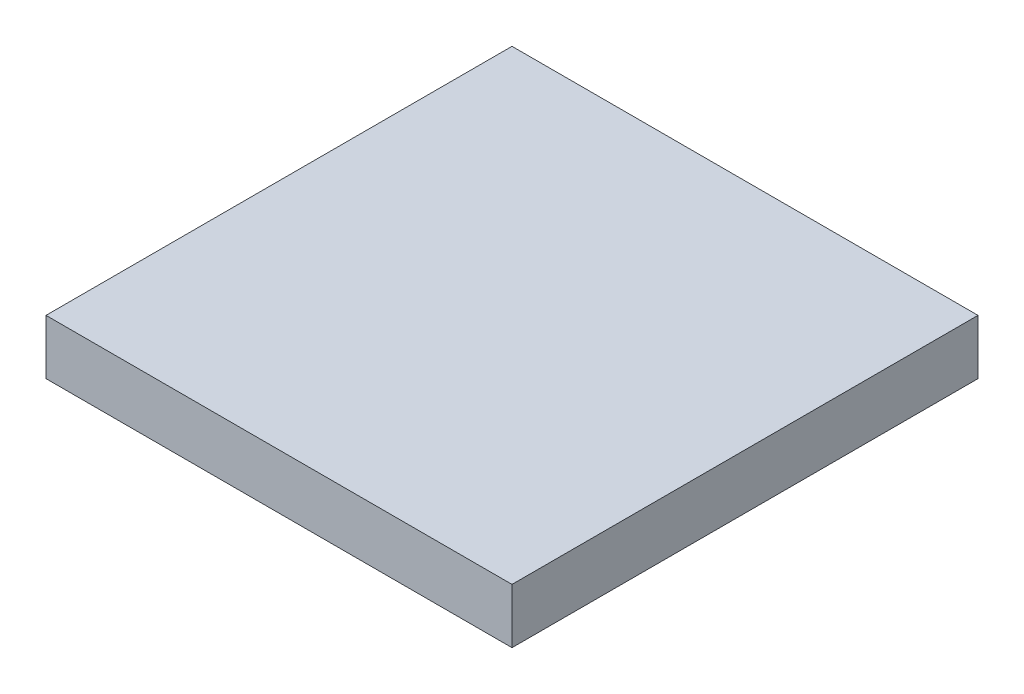
ISO-10303-21;
HEADER;
FILE_DESCRIPTION(('STEP AP214'),'2;1');
FILE_NAME('part.step','',(''),(''),'','','');
FILE_SCHEMA(('AUTOMOTIVE_DESIGN { 1 0 10303 214 1 1 1 1 }'));
ENDSEC;
DATA;
#1=APPLICATION_CONTEXT('core data for automotive mechanical design processes');
#2=APPLICATION_PROTOCOL_DEFINITION('international standard','automotive_design',2000,#1);
#3=PRODUCT_CONTEXT('',#1,'mechanical');
#4=PRODUCT('Part','Part','',(#3));
#5=PRODUCT_RELATED_PRODUCT_CATEGORY('part','',(#4));
#6=PRODUCT_DEFINITION_FORMATION('','',#4);
#7=PRODUCT_DEFINITION_CONTEXT('part definition',#1,'design');
#8=PRODUCT_DEFINITION('design','',#6,#7);
#9=PRODUCT_DEFINITION_SHAPE('','',#8);
#10=(LENGTH_UNIT() NAMED_UNIT(*) SI_UNIT(.MILLI.,.METRE.));
#11=(NAMED_UNIT(*) PLANE_ANGLE_UNIT() SI_UNIT($,.RADIAN.));
#12=(NAMED_UNIT(*) SI_UNIT($,.STERADIAN.) SOLID_ANGLE_UNIT());
#13=UNCERTAINTY_MEASURE_WITH_UNIT(LENGTH_MEASURE(1.E-05),#10,'distance_accuracy_value','');
#14=(GEOMETRIC_REPRESENTATION_CONTEXT(3) GLOBAL_UNCERTAINTY_ASSIGNED_CONTEXT((#13)) GLOBAL_UNIT_ASSIGNED_CONTEXT((#10,
#11,#12)) REPRESENTATION_CONTEXT('',''));
#15=CARTESIAN_POINT('',(0.,0.,0.));
#16=DIRECTION('',(0.,0.,1.));
#17=DIRECTION('',(1.,0.,0.));
#18=AXIS2_PLACEMENT_3D('',#15,#16,#17);
#19=CARTESIAN_POINT('',(19.5000000000108,-6.94999999998326,-3.74999999996223));
#20=DIRECTION('',(1.07887555098868E-12,0.,-1.));
#21=DIRECTION('',(0.,-1.,0.));
#22=AXIS2_PLACEMENT_3D('',#19,#20,#21);
#23=PLANE('',#22);
#24=DIRECTION('',(0.,-1.,0.));
#25=VECTOR('',#24,1.);
#26=CARTESIAN_POINT('',(11.0000000000108,-6.44999999998325,-3.7499999999714));
#27=LINE('',#26,#25);
#28=CARTESIAN_POINT('',(11.0000000000108,-6.44999999998325,-3.7499999999714));
#29=VERTEX_POINT('',#28);
#30=CARTESIAN_POINT('',(11.0000000000108,-7.44999999998326,-3.7499999999714));
#31=VERTEX_POINT('',#30);
#32=EDGE_CURVE('E63',#29,#31,#27,.T.);
#33=ORIENTED_EDGE('',*,*,#32,.F.);
#34=DIRECTION('',(-1.,0.,-1.07887555098868E-12));
#35=VECTOR('',#34,1.);
#36=CARTESIAN_POINT('',(19.5000000000108,-6.44999999998325,-3.74999999996223));
#37=LINE('',#36,#35);
#38=CARTESIAN_POINT('',(19.5000000000108,-6.44999999998325,-3.74999999996223));
#39=VERTEX_POINT('',#38);
#40=EDGE_CURVE('E41',#39,#29,#37,.T.);
#41=ORIENTED_EDGE('',*,*,#40,.F.);
#42=DIRECTION('',(0.,-1.,0.));
#43=VECTOR('',#42,1.);
#44=CARTESIAN_POINT('',(19.5000000000108,-6.44999999998325,-3.74999999996223));
#45=LINE('',#44,#43);
#46=CARTESIAN_POINT('',(19.5000000000108,-7.44999999998326,-3.74999999996223));
#47=VERTEX_POINT('',#46);
#48=EDGE_CURVE('E11',#39,#47,#45,.T.);
#49=ORIENTED_EDGE('',*,*,#48,.T.);
#50=DIRECTION('',(-1.,0.,-1.07887555098868E-12));
#51=VECTOR('',#50,1.);
#52=CARTESIAN_POINT('',(19.5000000000108,-7.44999999998326,-3.74999999996223));
#53=LINE('',#52,#51);
#54=EDGE_CURVE('E27',#47,#31,#53,.T.);
#55=ORIENTED_EDGE('',*,*,#54,.T.);
#56=EDGE_LOOP('',(#33,#41,#49,#55));
#57=FACE_BOUND('',#56,.T.);
#58=ADVANCED_FACE('F17',(#57),#23,.T.);
#59=CARTESIAN_POINT('',(11.0000000000108,-6.94999999998325,-3.74999999997141));
#60=DIRECTION('',(-1.,0.,-1.0822715272993E-12));
#61=DIRECTION('',(-1.0822715272993E-12,0.,1.));
#62=AXIS2_PLACEMENT_3D('',#59,#60,#61);
#63=PLANE('',#62);
#64=DIRECTION('',(0.,-1.,0.));
#65=VECTOR('',#64,1.);
#66=CARTESIAN_POINT('',(11.0000000000016,-6.44999999998325,4.7500000000286));
#67=LINE('',#66,#65);
#68=CARTESIAN_POINT('',(11.0000000000016,-6.44999999998325,4.7500000000286));
#69=VERTEX_POINT('',#68);
#70=CARTESIAN_POINT('',(11.0000000000016,-7.44999999998325,4.7500000000286));
#71=VERTEX_POINT('',#70);
#72=EDGE_CURVE('E77',#69,#71,#67,.T.);
#73=ORIENTED_EDGE('',*,*,#72,.F.);
#74=DIRECTION('',(-1.0822715272993E-12,0.,1.));
#75=VECTOR('',#74,1.);
#76=CARTESIAN_POINT('',(11.0000000000108,-6.44999999998325,-3.7499999999714));
#77=LINE('',#76,#75);
#78=EDGE_CURVE('E70',#29,#69,#77,.T.);
#79=ORIENTED_EDGE('',*,*,#78,.F.);
#80=ORIENTED_EDGE('',*,*,#32,.T.);
#81=DIRECTION('',(-1.0822715272993E-12,0.,1.));
#82=VECTOR('',#81,1.);
#83=CARTESIAN_POINT('',(11.0000000000108,-7.44999999998325,-3.7499999999714));
#84=LINE('',#83,#82);
#85=EDGE_CURVE('E80',#31,#71,#84,.T.);
#86=ORIENTED_EDGE('',*,*,#85,.T.);
#87=EDGE_LOOP('',(#73,#79,#80,#86));
#88=FACE_BOUND('',#87,.T.);
#89=ADVANCED_FACE('F78',(#88),#63,.T.);
#90=CARTESIAN_POINT('',(11.0000000000016,-6.94999999998325,4.7500000000286));
#91=DIRECTION('',(0.,0.,1.));
#92=DIRECTION('',(1.,1.07992046677656E-12,0.));
#93=AXIS2_PLACEMENT_3D('',#90,#91,#92);
#94=PLANE('',#93);
#95=DIRECTION('',(0.,-1.,0.));
#96=VECTOR('',#95,1.);
#97=CARTESIAN_POINT('',(19.5000000000016,-6.44999999998325,4.75000000003778));
#98=LINE('',#97,#96);
#99=CARTESIAN_POINT('',(19.5000000000016,-6.44999999998325,4.75000000003778));
#100=VERTEX_POINT('',#99);
#101=CARTESIAN_POINT('',(19.5000000000016,-7.44999999998325,4.75000000003778));
#102=VERTEX_POINT('',#101);
#103=EDGE_CURVE('E89',#100,#102,#98,.T.);
#104=ORIENTED_EDGE('',*,*,#103,.F.);
#105=DIRECTION('',(1.,0.,1.07992046677656E-12));
#106=VECTOR('',#105,1.);
#107=CARTESIAN_POINT('',(11.0000000000016,-6.44999999998325,4.7500000000286));
#108=LINE('',#107,#106);
#109=EDGE_CURVE('E74',#69,#100,#108,.T.);
#110=ORIENTED_EDGE('',*,*,#109,.F.);
#111=ORIENTED_EDGE('',*,*,#72,.T.);
#112=DIRECTION('',(1.,0.,1.07992046677656E-12));
#113=VECTOR('',#112,1.);
#114=CARTESIAN_POINT('',(11.0000000000016,-7.44999999998325,4.7500000000286));
#115=LINE('',#114,#113);
#116=EDGE_CURVE('E85',#71,#102,#115,.T.);
#117=ORIENTED_EDGE('',*,*,#116,.T.);
#118=EDGE_LOOP('',(#104,#110,#111,#117));
#119=FACE_BOUND('',#118,.T.);
#120=ADVANCED_FACE('F87',(#119),#94,.T.);
#121=CARTESIAN_POINT('',(15.2500000000062,-7.44999999998325,-3.7499999999714));
#122=DIRECTION('',(0.,-1.,0.));
#123=DIRECTION('',(0.,0.,-1.));
#124=AXIS2_PLACEMENT_3D('',#121,#122,#123);
#125=PLANE('',#124);
#126=DIRECTION('',(1.08253275624627E-12,0.,-1.));
#127=VECTOR('',#126,1.);
#128=CARTESIAN_POINT('',(19.5000000000016,-7.44999999998325,4.75000000003778));
#129=LINE('',#128,#127);
#130=EDGE_CURVE('E101',#102,#47,#129,.T.);
#131=ORIENTED_EDGE('',*,*,#130,.F.);
#132=ORIENTED_EDGE('',*,*,#116,.F.);
#133=ORIENTED_EDGE('',*,*,#85,.F.);
#134=ORIENTED_EDGE('',*,*,#54,.F.);
#135=EDGE_LOOP('',(#131,#132,#133,#134));
#136=FACE_BOUND('',#135,.T.);
#137=ADVANCED_FACE('F114',(#136),#125,.T.);
#138=CARTESIAN_POINT('',(19.5000000000016,-6.94999999998325,4.75000000003778));
#139=DIRECTION('',(1.,0.,0.));
#140=DIRECTION('',(0.,-1.08253275624627E-12,1.));
#141=AXIS2_PLACEMENT_3D('',#138,#139,#140);
#142=PLANE('',#141);
#143=ORIENTED_EDGE('',*,*,#48,.F.);
#144=DIRECTION('',(1.08253275624627E-12,0.,-1.));
#145=VECTOR('',#144,1.);
#146=CARTESIAN_POINT('',(19.5000000000016,-6.44999999998325,4.75000000003778));
#147=LINE('',#146,#145);
#148=EDGE_CURVE('E20',#100,#39,#147,.T.);
#149=ORIENTED_EDGE('',*,*,#148,.F.);
#150=ORIENTED_EDGE('',*,*,#103,.T.);
#151=ORIENTED_EDGE('',*,*,#130,.T.);
#152=EDGE_LOOP('',(#143,#149,#150,#151));
#153=FACE_BOUND('',#152,.T.);
#154=ADVANCED_FACE('F117',(#153),#142,.T.);
#155=CARTESIAN_POINT('',(19.5000000000108,-6.44999999998325,0.500000000033191));
#156=DIRECTION('',(0.,1.,0.));
#157=DIRECTION('',(1.,0.,0.));
#158=AXIS2_PLACEMENT_3D('',#155,#156,#157);
#159=PLANE('',#158);
#160=ORIENTED_EDGE('',*,*,#40,.T.);
#161=ORIENTED_EDGE('',*,*,#78,.T.);
#162=ORIENTED_EDGE('',*,*,#109,.T.);
#163=ORIENTED_EDGE('',*,*,#148,.T.);
#164=EDGE_LOOP('',(#160,#161,#162,#163));
#165=FACE_BOUND('',#164,.T.);
#166=ADVANCED_FACE('F72',(#165),#159,.T.);
#167=CLOSED_SHELL('',(#58,#89,#120,#137,#154,#166));
#168=MANIFOLD_SOLID_BREP('B1',#167);
#169=ADVANCED_BREP_SHAPE_REPRESENTATION('',(#18,#168),#14);
#170=SHAPE_DEFINITION_REPRESENTATION(#9,#169);
ENDSEC;
END-ISO-10303-21;
